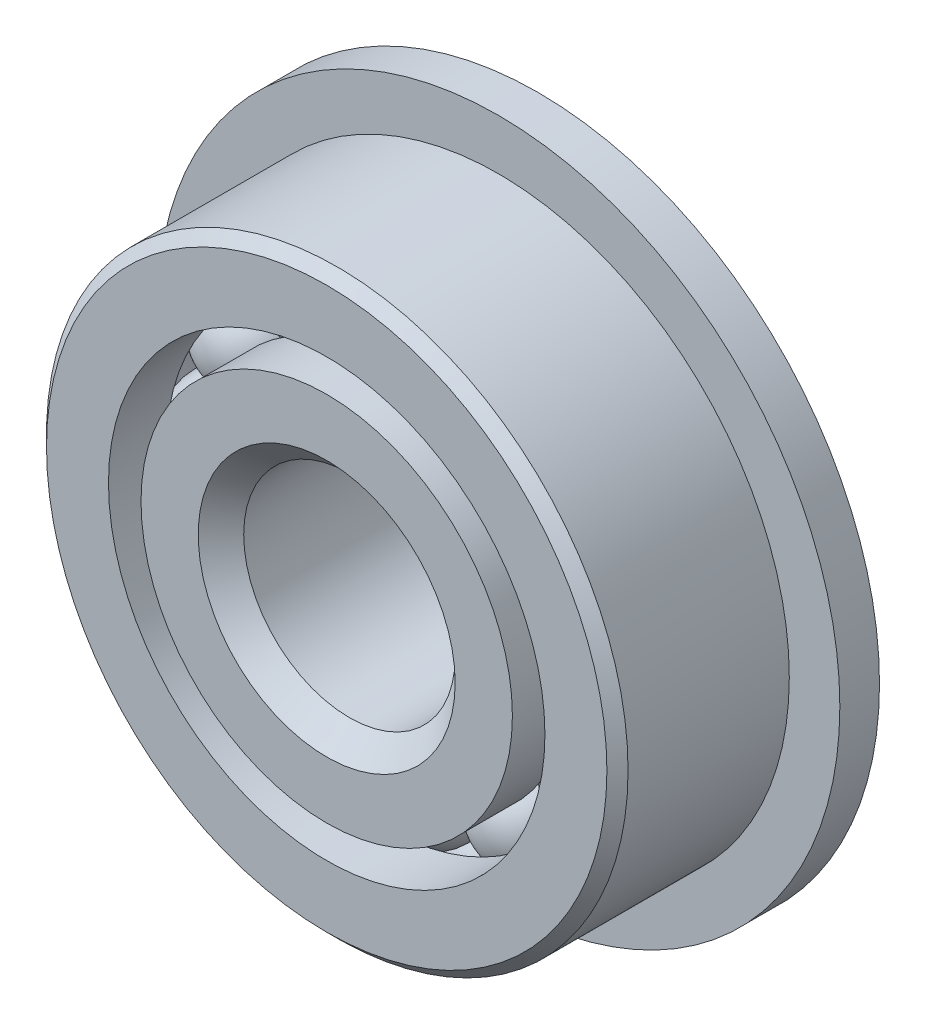
ISO-10303-21;
HEADER;
FILE_DESCRIPTION(('STEP AP214'),'2;1');
FILE_NAME('part.step','',(''),(''),'','','');
FILE_SCHEMA(('AUTOMOTIVE_DESIGN { 1 0 10303 214 1 1 1 1 }'));
ENDSEC;
DATA;
#1=APPLICATION_CONTEXT('core data for automotive mechanical design processes');
#2=APPLICATION_PROTOCOL_DEFINITION('international standard','automotive_design',2000,#1);
#3=PRODUCT_CONTEXT('',#1,'mechanical');
#4=PRODUCT('Part','Part','',(#3));
#5=PRODUCT_RELATED_PRODUCT_CATEGORY('part','',(#4));
#6=PRODUCT_DEFINITION_FORMATION('','',#4);
#7=PRODUCT_DEFINITION_CONTEXT('part definition',#1,'design');
#8=PRODUCT_DEFINITION('design','',#6,#7);
#9=PRODUCT_DEFINITION_SHAPE('','',#8);
#10=(LENGTH_UNIT() NAMED_UNIT(*) SI_UNIT(.MILLI.,.METRE.));
#11=(NAMED_UNIT(*) PLANE_ANGLE_UNIT() SI_UNIT($,.RADIAN.));
#12=(NAMED_UNIT(*) SI_UNIT($,.STERADIAN.) SOLID_ANGLE_UNIT());
#13=UNCERTAINTY_MEASURE_WITH_UNIT(LENGTH_MEASURE(1.E-05),#10,'distance_accuracy_value','');
#14=(GEOMETRIC_REPRESENTATION_CONTEXT(3) GLOBAL_UNCERTAINTY_ASSIGNED_CONTEXT((#13)) GLOBAL_UNIT_ASSIGNED_CONTEXT((#10,
#11,#12)) REPRESENTATION_CONTEXT('',''));
#15=CARTESIAN_POINT('',(0.,0.,0.));
#16=DIRECTION('',(0.,0.,1.));
#17=DIRECTION('',(1.,0.,0.));
#18=AXIS2_PLACEMENT_3D('',#15,#16,#17);
#19=CARTESIAN_POINT('',(-3.03212499999993,5.25179455489982,0.));
#20=DIRECTION('',(0.,0.,1.));
#21=DIRECTION('',(-0.499999999999989,0.866025403784445,0.));
#22=AXIS2_PLACEMENT_3D('',#19,#20,#21);
#23=SPHERICAL_SURFACE('',#22,1.524);
#24=CARTESIAN_POINT('',(-3.03212499999993,5.25179455489982,1.524));
#25=VERTEX_POINT('',#24);
#26=VERTEX_LOOP('',#25);
#27=FACE_BOUND('',#26,.T.);
#28=ADVANCED_FACE('F33',(#27),#23,.T.);
#29=CLOSED_SHELL('',(#28));
#30=MANIFOLD_SOLID_BREP('B2',#29);
#31=CARTESIAN_POINT('',(-5.25179455489975,3.03212500000006,0.));
#32=DIRECTION('',(0.,0.,1.));
#33=DIRECTION('',(-0.866025403784433,0.50000000000001,0.));
#34=AXIS2_PLACEMENT_3D('',#31,#32,#33);
#35=SPHERICAL_SURFACE('',#34,1.524);
#36=CARTESIAN_POINT('',(-5.25179455489975,3.03212500000006,1.524));
#37=VERTEX_POINT('',#36);
#38=VERTEX_LOOP('',#37);
#39=FACE_BOUND('',#38,.T.);
#40=ADVANCED_FACE('F51',(#39),#35,.T.);
#41=CLOSED_SHELL('',(#40));
#42=MANIFOLD_SOLID_BREP('B6',#41);
#43=CARTESIAN_POINT('',(-6.06425,0.,0.));
#44=DIRECTION('',(0.,0.,1.));
#45=DIRECTION('',(-1.,0.,0.));
#46=AXIS2_PLACEMENT_3D('',#43,#44,#45);
#47=SPHERICAL_SURFACE('',#46,1.524);
#48=CARTESIAN_POINT('',(-6.06425,0.,1.524));
#49=VERTEX_POINT('',#48);
#50=VERTEX_LOOP('',#49);
#51=FACE_BOUND('',#50,.T.);
#52=ADVANCED_FACE('F69',(#51),#47,.T.);
#53=CLOSED_SHELL('',(#52));
#54=MANIFOLD_SOLID_BREP('B29',#53);
#55=CARTESIAN_POINT('',(-5.25179455489981,-3.03212499999995,0.));
#56=DIRECTION('',(0.,0.,1.));
#57=DIRECTION('',(-0.866025403784443,-0.499999999999992,0.));
#58=AXIS2_PLACEMENT_3D('',#55,#56,#57);
#59=SPHERICAL_SURFACE('',#58,1.524);
#60=CARTESIAN_POINT('',(-5.25179455489981,-3.03212499999995,1.524));
#61=VERTEX_POINT('',#60);
#62=VERTEX_LOOP('',#61);
#63=FACE_BOUND('',#62,.T.);
#64=ADVANCED_FACE('F87',(#63),#59,.T.);
#65=CLOSED_SHELL('',(#64));
#66=MANIFOLD_SOLID_BREP('B47',#65);
#67=CARTESIAN_POINT('',(-3.03212500000004,-5.25179455489976,0.));
#68=DIRECTION('',(0.,0.,1.));
#69=DIRECTION('',(-0.500000000000007,-0.866025403784435,0.));
#70=AXIS2_PLACEMENT_3D('',#67,#68,#69);
#71=SPHERICAL_SURFACE('',#70,1.524);
#72=CARTESIAN_POINT('',(-3.03212500000004,-5.25179455489976,1.524));
#73=VERTEX_POINT('',#72);
#74=VERTEX_LOOP('',#73);
#75=FACE_BOUND('',#74,.T.);
#76=ADVANCED_FACE('F105',(#75),#71,.T.);
#77=CLOSED_SHELL('',(#76));
#78=MANIFOLD_SOLID_BREP('B65',#77);
#79=CARTESIAN_POINT('',(0.,-6.06425,0.));
#80=DIRECTION('',(0.,0.,1.));
#81=DIRECTION('',(0.,-1.,0.));
#82=AXIS2_PLACEMENT_3D('',#79,#80,#81);
#83=SPHERICAL_SURFACE('',#82,1.524);
#84=CARTESIAN_POINT('',(0.,-6.06425,1.524));
#85=VERTEX_POINT('',#84);
#86=VERTEX_LOOP('',#85);
#87=FACE_BOUND('',#86,.T.);
#88=ADVANCED_FACE('F123',(#87),#83,.T.);
#89=CLOSED_SHELL('',(#88));
#90=MANIFOLD_SOLID_BREP('B83',#89);
#91=CARTESIAN_POINT('',(3.03212499999997,-5.2517945548998,0.));
#92=DIRECTION('',(0.,0.,1.));
#93=DIRECTION('',(0.499999999999995,-0.866025403784442,0.));
#94=AXIS2_PLACEMENT_3D('',#91,#92,#93);
#95=SPHERICAL_SURFACE('',#94,1.524);
#96=CARTESIAN_POINT('',(3.03212499999997,-5.2517945548998,1.524));
#97=VERTEX_POINT('',#96);
#98=VERTEX_LOOP('',#97);
#99=FACE_BOUND('',#98,.T.);
#100=ADVANCED_FACE('F141',(#99),#95,.T.);
#101=CLOSED_SHELL('',(#100));
#102=MANIFOLD_SOLID_BREP('B101',#101);
#103=CARTESIAN_POINT('',(5.25179455489977,-3.03212500000002,0.));
#104=DIRECTION('',(0.,0.,1.));
#105=DIRECTION('',(0.866025403784436,-0.500000000000004,0.));
#106=AXIS2_PLACEMENT_3D('',#103,#104,#105);
#107=SPHERICAL_SURFACE('',#106,1.524);
#108=CARTESIAN_POINT('',(5.25179455489977,-3.03212500000002,1.524));
#109=VERTEX_POINT('',#108);
#110=VERTEX_LOOP('',#109);
#111=FACE_BOUND('',#110,.T.);
#112=ADVANCED_FACE('F159',(#111),#107,.T.);
#113=CLOSED_SHELL('',(#112));
#114=MANIFOLD_SOLID_BREP('B119',#113);
#115=CARTESIAN_POINT('',(6.06425,0.,0.));
#116=DIRECTION('',(0.,0.,1.));
#117=DIRECTION('',(1.,0.,0.));
#118=AXIS2_PLACEMENT_3D('',#115,#116,#117);
#119=SPHERICAL_SURFACE('',#118,1.524);
#120=CARTESIAN_POINT('',(6.06425,0.,1.524));
#121=VERTEX_POINT('',#120);
#122=VERTEX_LOOP('',#121);
#123=FACE_BOUND('',#122,.T.);
#124=ADVANCED_FACE('F177',(#123),#119,.T.);
#125=CLOSED_SHELL('',(#124));
#126=MANIFOLD_SOLID_BREP('B137',#125);
#127=CARTESIAN_POINT('',(5.25179455489979,3.03212499999999,0.));
#128=DIRECTION('',(0.,0.,1.));
#129=DIRECTION('',(0.86602540378444,0.499999999999998,0.));
#130=AXIS2_PLACEMENT_3D('',#127,#128,#129);
#131=SPHERICAL_SURFACE('',#130,1.524);
#132=CARTESIAN_POINT('',(5.25179455489979,3.03212499999999,1.524));
#133=VERTEX_POINT('',#132);
#134=VERTEX_LOOP('',#133);
#135=FACE_BOUND('',#134,.T.);
#136=ADVANCED_FACE('F195',(#135),#131,.T.);
#137=CLOSED_SHELL('',(#136));
#138=MANIFOLD_SOLID_BREP('B155',#137);
#139=CARTESIAN_POINT('',(3.03212500000001,5.25179455489978,0.));
#140=DIRECTION('',(0.,0.,1.));
#141=DIRECTION('',(0.500000000000001,0.866025403784438,0.));
#142=AXIS2_PLACEMENT_3D('',#139,#140,#141);
#143=SPHERICAL_SURFACE('',#142,1.524);
#144=CARTESIAN_POINT('',(3.03212500000001,5.25179455489978,1.524));
#145=VERTEX_POINT('',#144);
#146=VERTEX_LOOP('',#145);
#147=FACE_BOUND('',#146,.T.);
#148=ADVANCED_FACE('F213',(#147),#143,.T.);
#149=CLOSED_SHELL('',(#148));
#150=MANIFOLD_SOLID_BREP('B173',#149);
#151=CARTESIAN_POINT('',(0.,6.06425,0.));
#152=DIRECTION('',(0.,0.,1.));
#153=DIRECTION('',(0.,1.,0.));
#154=AXIS2_PLACEMENT_3D('',#151,#152,#153);
#155=SPHERICAL_SURFACE('',#154,1.524);
#156=CARTESIAN_POINT('',(0.,6.06425,1.524));
#157=VERTEX_POINT('',#156);
#158=VERTEX_LOOP('',#157);
#159=FACE_BOUND('',#158,.T.);
#160=ADVANCED_FACE('F233',(#159),#155,.T.);
#161=CLOSED_SHELL('',(#160));
#162=MANIFOLD_SOLID_BREP('B191',#161);
#163=CARTESIAN_POINT('',(0.,0.,3.175));
#164=DIRECTION('',(0.,0.,1.));
#165=DIRECTION('',(1.,0.,0.));
#166=AXIS2_PLACEMENT_3D('',#163,#164,#165);
#167=CYLINDRICAL_SURFACE('',#166,5.57578846153846);
#168=CARTESIAN_POINT('',(0.,0.,-1.44360012657376));
#169=DIRECTION('',(0.,0.,1.));
#170=DIRECTION('',(1.,0.,0.));
#171=AXIS2_PLACEMENT_3D('',#168,#169,#170);
#172=CIRCLE('',#171,5.57578846153846);
#173=CARTESIAN_POINT('',(5.57578846153846,0.,-1.44360012657376));
#174=VERTEX_POINT('',#173);
#175=EDGE_CURVE('E263',#174,#174,#172,.T.);
#176=ORIENTED_EDGE('',*,*,#175,.F.);
#177=EDGE_LOOP('',(#176));
#178=FACE_BOUND('',#177,.T.);
#179=CARTESIAN_POINT('',(0.,0.,-4.7625));
#180=DIRECTION('',(0.,0.,1.));
#181=DIRECTION('',(1.,0.,0.));
#182=AXIS2_PLACEMENT_3D('',#179,#180,#181);
#183=CIRCLE('',#182,5.57578846153846);
#184=CARTESIAN_POINT('',(5.57578846153846,0.,-4.7625));
#185=VERTEX_POINT('',#184);
#186=EDGE_CURVE('E267',#185,#185,#183,.T.);
#187=ORIENTED_EDGE('',*,*,#186,.T.);
#188=EDGE_LOOP('',(#187));
#189=FACE_BOUND('',#188,.T.);
#190=ADVANCED_FACE('F252',(#178,#189),#167,.T.);
#191=CARTESIAN_POINT('',(0.,3.4925,-4.7625));
#192=DIRECTION('',(0.,0.,1.));
#193=DIRECTION('',(1.,0.,0.));
#194=AXIS2_PLACEMENT_3D('',#191,#192,#193);
#195=PLANE('',#194);
#196=ORIENTED_EDGE('',*,*,#186,.F.);
#197=EDGE_LOOP('',(#196));
#198=FACE_BOUND('',#197,.T.);
#199=CARTESIAN_POINT('',(0.,0.,-4.7625));
#200=DIRECTION('',(0.,0.,1.));
#201=DIRECTION('',(1.,0.,0.));
#202=AXIS2_PLACEMENT_3D('',#199,#200,#201);
#203=CIRCLE('',#202,3.4925);
#204=CARTESIAN_POINT('',(3.4925,0.,-4.7625));
#205=VERTEX_POINT('',#204);
#206=EDGE_CURVE('E272',#205,#205,#203,.T.);
#207=ORIENTED_EDGE('',*,*,#206,.T.);
#208=EDGE_LOOP('',(#207));
#209=FACE_BOUND('',#208,.T.);
#210=ADVANCED_FACE('F299',(#198,#209),#195,.F.);
#211=CARTESIAN_POINT('',(0.,0.,-4.445));
#212=DIRECTION('',(0.,0.,-1.));
#213=DIRECTION('',(-1.,0.,0.));
#214=AXIS2_PLACEMENT_3D('',#211,#212,#213);
#215=CONICAL_SURFACE('',#214,3.175,0.785398163397443);
#216=ORIENTED_EDGE('',*,*,#206,.F.);
#217=EDGE_LOOP('',(#216));
#218=FACE_BOUND('',#217,.T.);
#219=CARTESIAN_POINT('',(0.,0.,-4.445));
#220=DIRECTION('',(0.,0.,1.));
#221=DIRECTION('',(1.,0.,0.));
#222=AXIS2_PLACEMENT_3D('',#219,#220,#221);
#223=CIRCLE('',#222,3.175);
#224=CARTESIAN_POINT('',(3.175,0.,-4.445));
#225=VERTEX_POINT('',#224);
#226=EDGE_CURVE('E275',#225,#225,#223,.T.);
#227=ORIENTED_EDGE('',*,*,#226,.T.);
#228=EDGE_LOOP('',(#227));
#229=FACE_BOUND('',#228,.T.);
#230=ADVANCED_FACE('F305',(#218,#229),#215,.F.);
#231=CARTESIAN_POINT('',(0.,0.,3.175));
#232=DIRECTION('',(0.,0.,1.));
#233=DIRECTION('',(1.,0.,0.));
#234=AXIS2_PLACEMENT_3D('',#231,#232,#233);
#235=CYLINDRICAL_SURFACE('',#234,3.175);
#236=ORIENTED_EDGE('',*,*,#226,.F.);
#237=EDGE_LOOP('',(#236));
#238=FACE_BOUND('',#237,.T.);
#239=CARTESIAN_POINT('',(0.,0.,2.492375));
#240=DIRECTION('',(0.,0.,1.));
#241=DIRECTION('',(1.,0.,0.));
#242=AXIS2_PLACEMENT_3D('',#239,#240,#241);
#243=CIRCLE('',#242,3.175);
#244=CARTESIAN_POINT('',(3.175,0.,2.492375));
#245=VERTEX_POINT('',#244);
#246=EDGE_CURVE('E278',#245,#245,#243,.T.);
#247=ORIENTED_EDGE('',*,*,#246,.T.);
#248=EDGE_LOOP('',(#247));
#249=FACE_BOUND('',#248,.T.);
#250=ADVANCED_FACE('F295',(#238,#249),#235,.F.);
#251=CARTESIAN_POINT('',(0.,0.,3.175));
#252=DIRECTION('',(0.,0.,1.));
#253=DIRECTION('',(1.,0.,0.));
#254=AXIS2_PLACEMENT_3D('',#251,#252,#253);
#255=CONICAL_SURFACE('',#254,3.857625,0.78539816339745);
#256=ORIENTED_EDGE('',*,*,#246,.F.);
#257=EDGE_LOOP('',(#256));
#258=FACE_BOUND('',#257,.T.);
#259=CARTESIAN_POINT('',(0.,0.,3.175));
#260=DIRECTION('',(0.,0.,1.));
#261=DIRECTION('',(1.,0.,0.));
#262=AXIS2_PLACEMENT_3D('',#259,#260,#261);
#263=CIRCLE('',#262,3.857625);
#264=CARTESIAN_POINT('',(3.857625,0.,3.175));
#265=VERTEX_POINT('',#264);
#266=EDGE_CURVE('E281',#265,#265,#263,.T.);
#267=ORIENTED_EDGE('',*,*,#266,.T.);
#268=EDGE_LOOP('',(#267));
#269=FACE_BOUND('',#268,.T.);
#270=ADVANCED_FACE('F285',(#258,#269),#255,.F.);
#271=CARTESIAN_POINT('',(0.,5.57578846153846,3.175));
#272=DIRECTION('',(0.,0.,-1.));
#273=DIRECTION('',(-1.,0.,0.));
#274=AXIS2_PLACEMENT_3D('',#271,#272,#273);
#275=PLANE('',#274);
#276=CARTESIAN_POINT('',(0.,0.,3.175));
#277=DIRECTION('',(0.,0.,1.));
#278=DIRECTION('',(1.,0.,0.));
#279=AXIS2_PLACEMENT_3D('',#276,#277,#278);
#280=CIRCLE('',#279,5.57578846153846);
#281=CARTESIAN_POINT('',(5.57578846153846,0.,3.175));
#282=VERTEX_POINT('',#281);
#283=EDGE_CURVE('E259',#282,#282,#280,.T.);
#284=ORIENTED_EDGE('',*,*,#283,.T.);
#285=EDGE_LOOP('',(#284));
#286=FACE_BOUND('',#285,.T.);
#287=ORIENTED_EDGE('',*,*,#266,.F.);
#288=EDGE_LOOP('',(#287));
#289=FACE_BOUND('',#288,.T.);
#290=ADVANCED_FACE('F254',(#286,#289),#275,.F.);
#291=CARTESIAN_POINT('',(0.,0.,0.));
#292=DIRECTION('',(0.,0.,1.));
#293=DIRECTION('',(1.,0.,0.));
#294=AXIS2_PLACEMENT_3D('',#291,#292,#293);
#295=TOROIDAL_SURFACE('',#294,6.06425,1.524);
#296=CARTESIAN_POINT('',(0.,0.,1.44360012657376));
#297=DIRECTION('',(0.,0.,1.));
#298=DIRECTION('',(1.,0.,0.));
#299=AXIS2_PLACEMENT_3D('',#296,#297,#298);
#300=CIRCLE('',#299,5.57578846153846);
#301=CARTESIAN_POINT('',(5.57578846153846,0.,1.44360012657376));
#302=VERTEX_POINT('',#301);
#303=EDGE_CURVE('E232',#302,#302,#300,.T.);
#304=ORIENTED_EDGE('',*,*,#303,.F.);
#305=EDGE_LOOP('',(#304));
#306=FACE_BOUND('',#305,.T.);
#307=ORIENTED_EDGE('',*,*,#175,.T.);
#308=EDGE_LOOP('',(#307));
#309=FACE_BOUND('',#308,.T.);
#310=ADVANCED_FACE('F288',(#306,#309),#295,.F.);
#311=CARTESIAN_POINT('',(0.,0.,3.175));
#312=DIRECTION('',(0.,0.,1.));
#313=DIRECTION('',(1.,0.,0.));
#314=AXIS2_PLACEMENT_3D('',#311,#312,#313);
#315=CYLINDRICAL_SURFACE('',#314,5.57578846153846);
#316=ORIENTED_EDGE('',*,*,#283,.F.);
#317=EDGE_LOOP('',(#316));
#318=FACE_BOUND('',#317,.T.);
#319=ORIENTED_EDGE('',*,*,#303,.T.);
#320=EDGE_LOOP('',(#319));
#321=FACE_BOUND('',#320,.T.);
#322=ADVANCED_FACE('F293',(#318,#321),#315,.T.);
#323=CLOSED_SHELL('',(#190,#210,#230,#250,#270,#290,#310,#322));
#324=MANIFOLD_SOLID_BREP('B209',#323);
#325=CARTESIAN_POINT('',(0.,0.,2.8575));
#326=DIRECTION('',(0.,0.,-1.));
#327=DIRECTION('',(-1.,0.,0.));
#328=AXIS2_PLACEMENT_3D('',#325,#326,#327);
#329=CONICAL_SURFACE('',#328,8.73125,0.785398163397446);
#330=CARTESIAN_POINT('',(0.,0.,3.175));
#331=DIRECTION('',(0.,0.,1.));
#332=DIRECTION('',(1.,0.,0.));
#333=AXIS2_PLACEMENT_3D('',#330,#331,#332);
#334=CIRCLE('',#333,8.41375);
#335=CARTESIAN_POINT('',(8.41375,0.,3.175));
#336=VERTEX_POINT('',#335);
#337=EDGE_CURVE('E401',#336,#336,#334,.T.);
#338=ORIENTED_EDGE('',*,*,#337,.F.);
#339=EDGE_LOOP('',(#338));
#340=FACE_BOUND('',#339,.T.);
#341=CARTESIAN_POINT('',(0.,0.,2.8575));
#342=DIRECTION('',(0.,0.,1.));
#343=DIRECTION('',(1.,0.,0.));
#344=AXIS2_PLACEMENT_3D('',#341,#342,#343);
#345=CIRCLE('',#344,8.73125);
#346=CARTESIAN_POINT('',(8.73125,0.,2.8575));
#347=VERTEX_POINT('',#346);
#348=EDGE_CURVE('E251',#347,#347,#345,.T.);
#349=ORIENTED_EDGE('',*,*,#348,.T.);
#350=EDGE_LOOP('',(#349));
#351=FACE_BOUND('',#350,.T.);
#352=ADVANCED_FACE('F379',(#340,#351),#329,.T.);
#353=CARTESIAN_POINT('',(0.,0.,3.175));
#354=DIRECTION('',(0.,0.,1.));
#355=DIRECTION('',(1.,0.,0.));
#356=AXIS2_PLACEMENT_3D('',#353,#354,#355);
#357=CYLINDRICAL_SURFACE('',#356,8.73125);
#358=CARTESIAN_POINT('',(0.,0.,-1.984375));
#359=DIRECTION('',(0.,0.,1.));
#360=DIRECTION('',(1.,0.,0.));
#361=AXIS2_PLACEMENT_3D('',#358,#359,#360);
#362=CIRCLE('',#361,8.73125);
#363=CARTESIAN_POINT('',(8.73125,0.,-1.984375));
#364=VERTEX_POINT('',#363);
#365=EDGE_CURVE('E382',#364,#364,#362,.T.);
#366=ORIENTED_EDGE('',*,*,#365,.T.);
#367=EDGE_LOOP('',(#366));
#368=FACE_BOUND('',#367,.T.);
#369=ORIENTED_EDGE('',*,*,#348,.F.);
#370=EDGE_LOOP('',(#369));
#371=FACE_BOUND('',#370,.T.);
#372=ADVANCED_FACE('F422',(#368,#371),#357,.T.);
#373=CARTESIAN_POINT('',(0.,8.41375,-3.175));
#374=DIRECTION('',(0.,0.,1.));
#375=DIRECTION('',(1.,0.,0.));
#376=AXIS2_PLACEMENT_3D('',#373,#374,#375);
#377=PLANE('',#376);
#378=CARTESIAN_POINT('',(0.,0.,-3.175));
#379=DIRECTION('',(0.,0.,1.));
#380=DIRECTION('',(1.,0.,0.));
#381=AXIS2_PLACEMENT_3D('',#378,#379,#380);
#382=CIRCLE('',#381,6.55271153846154);
#383=CARTESIAN_POINT('',(6.55271153846154,0.,-3.175));
#384=VERTEX_POINT('',#383);
#385=EDGE_CURVE('E386',#384,#384,#382,.T.);
#386=ORIENTED_EDGE('',*,*,#385,.T.);
#387=EDGE_LOOP('',(#386));
#388=FACE_BOUND('',#387,.T.);
#389=CARTESIAN_POINT('',(0.,0.,-3.175));
#390=DIRECTION('',(0.,0.,-1.));
#391=DIRECTION('',(-1.,0.,0.));
#392=AXIS2_PLACEMENT_3D('',#389,#390,#391);
#393=CIRCLE('',#392,10.2489);
#394=CARTESIAN_POINT('',(-10.2489,0.,-3.175));
#395=VERTEX_POINT('',#394);
#396=EDGE_CURVE('E404',#395,#395,#393,.T.);
#397=ORIENTED_EDGE('',*,*,#396,.T.);
#398=EDGE_LOOP('',(#397));
#399=FACE_BOUND('',#398,.T.);
#400=ADVANCED_FACE('F425',(#388,#399),#377,.F.);
#401=CARTESIAN_POINT('',(0.,0.,3.175));
#402=DIRECTION('',(0.,0.,1.));
#403=DIRECTION('',(1.,0.,0.));
#404=AXIS2_PLACEMENT_3D('',#401,#402,#403);
#405=CYLINDRICAL_SURFACE('',#404,6.55271153846154);
#406=ORIENTED_EDGE('',*,*,#385,.F.);
#407=EDGE_LOOP('',(#406));
#408=FACE_BOUND('',#407,.T.);
#409=CARTESIAN_POINT('',(0.,0.,-1.44360012657376));
#410=DIRECTION('',(0.,0.,1.));
#411=DIRECTION('',(1.,0.,0.));
#412=AXIS2_PLACEMENT_3D('',#409,#410,#411);
#413=CIRCLE('',#412,6.55271153846154);
#414=CARTESIAN_POINT('',(6.55271153846154,0.,-1.44360012657376));
#415=VERTEX_POINT('',#414);
#416=EDGE_CURVE('E390',#415,#415,#413,.T.);
#417=ORIENTED_EDGE('',*,*,#416,.T.);
#418=EDGE_LOOP('',(#417));
#419=FACE_BOUND('',#418,.T.);
#420=ADVANCED_FACE('F430',(#408,#419),#405,.F.);
#421=CARTESIAN_POINT('',(0.,0.,0.));
#422=DIRECTION('',(0.,0.,1.));
#423=DIRECTION('',(1.,0.,0.));
#424=AXIS2_PLACEMENT_3D('',#421,#422,#423);
#425=TOROIDAL_SURFACE('',#424,6.06425,1.524);
#426=ORIENTED_EDGE('',*,*,#416,.F.);
#427=EDGE_LOOP('',(#426));
#428=FACE_BOUND('',#427,.T.);
#429=CARTESIAN_POINT('',(0.,0.,1.44360012657376));
#430=DIRECTION('',(0.,0.,1.));
#431=DIRECTION('',(1.,0.,0.));
#432=AXIS2_PLACEMENT_3D('',#429,#430,#431);
#433=CIRCLE('',#432,6.55271153846154);
#434=CARTESIAN_POINT('',(6.55271153846154,0.,1.44360012657376));
#435=VERTEX_POINT('',#434);
#436=EDGE_CURVE('E395',#435,#435,#433,.T.);
#437=ORIENTED_EDGE('',*,*,#436,.T.);
#438=EDGE_LOOP('',(#437));
#439=FACE_BOUND('',#438,.T.);
#440=ADVANCED_FACE('F437',(#428,#439),#425,.F.);
#441=CARTESIAN_POINT('',(0.,0.,3.175));
#442=DIRECTION('',(0.,0.,1.));
#443=DIRECTION('',(1.,0.,0.));
#444=AXIS2_PLACEMENT_3D('',#441,#442,#443);
#445=CYLINDRICAL_SURFACE('',#444,6.55271153846154);
#446=ORIENTED_EDGE('',*,*,#436,.F.);
#447=EDGE_LOOP('',(#446));
#448=FACE_BOUND('',#447,.T.);
#449=CARTESIAN_POINT('',(0.,0.,3.175));
#450=DIRECTION('',(0.,0.,1.));
#451=DIRECTION('',(1.,0.,0.));
#452=AXIS2_PLACEMENT_3D('',#449,#450,#451);
#453=CIRCLE('',#452,6.55271153846154);
#454=CARTESIAN_POINT('',(6.55271153846154,0.,3.175));
#455=VERTEX_POINT('',#454);
#456=EDGE_CURVE('E398',#455,#455,#453,.T.);
#457=ORIENTED_EDGE('',*,*,#456,.T.);
#458=EDGE_LOOP('',(#457));
#459=FACE_BOUND('',#458,.T.);
#460=ADVANCED_FACE('F441',(#448,#459),#445,.F.);
#461=CARTESIAN_POINT('',(0.,8.41375,3.175));
#462=DIRECTION('',(0.,0.,-1.));
#463=DIRECTION('',(-1.,0.,0.));
#464=AXIS2_PLACEMENT_3D('',#461,#462,#463);
#465=PLANE('',#464);
#466=ORIENTED_EDGE('',*,*,#456,.F.);
#467=EDGE_LOOP('',(#466));
#468=FACE_BOUND('',#467,.T.);
#469=ORIENTED_EDGE('',*,*,#337,.T.);
#470=EDGE_LOOP('',(#469));
#471=FACE_BOUND('',#470,.T.);
#472=ADVANCED_FACE('F417',(#468,#471),#465,.F.);
#473=CARTESIAN_POINT('',(0.,7.48323076923077,-1.984375));
#474=DIRECTION('',(0.,0.,1.));
#475=DIRECTION('',(1.,0.,0.));
#476=AXIS2_PLACEMENT_3D('',#473,#474,#475);
#477=PLANE('',#476);
#478=CARTESIAN_POINT('',(0.,0.,-1.984375));
#479=DIRECTION('',(0.,0.,-1.));
#480=DIRECTION('',(-1.,0.,0.));
#481=AXIS2_PLACEMENT_3D('',#478,#479,#480);
#482=CIRCLE('',#481,10.2489);
#483=CARTESIAN_POINT('',(-10.2489,0.,-1.984375));
#484=VERTEX_POINT('',#483);
#485=EDGE_CURVE('E407',#484,#484,#482,.T.);
#486=ORIENTED_EDGE('',*,*,#485,.F.);
#487=EDGE_LOOP('',(#486));
#488=FACE_BOUND('',#487,.T.);
#489=ORIENTED_EDGE('',*,*,#365,.F.);
#490=EDGE_LOOP('',(#489));
#491=FACE_BOUND('',#490,.T.);
#492=ADVANCED_FACE('F414',(#488,#491),#477,.T.);
#493=CARTESIAN_POINT('',(0.,0.,-4.7625));
#494=DIRECTION('',(0.,0.,-1.));
#495=DIRECTION('',(-1.,0.,0.));
#496=AXIS2_PLACEMENT_3D('',#493,#494,#495);
#497=CYLINDRICAL_SURFACE('',#496,10.2489);
#498=ORIENTED_EDGE('',*,*,#485,.T.);
#499=EDGE_LOOP('',(#498));
#500=FACE_BOUND('',#499,.T.);
#501=ORIENTED_EDGE('',*,*,#396,.F.);
#502=EDGE_LOOP('',(#501));
#503=FACE_BOUND('',#502,.T.);
#504=ADVANCED_FACE('F411',(#500,#503),#497,.T.);
#505=CLOSED_SHELL('',(#352,#372,#400,#420,#440,#460,#472,#492,#504));
#506=MANIFOLD_SOLID_BREP('B227',#505);
#507=ADVANCED_BREP_SHAPE_REPRESENTATION('',(#18,#30,#42,#54,#66,#78,#90,#102,#114,#126,#138,
#150,#162,#324,#506),#14);
#508=SHAPE_DEFINITION_REPRESENTATION(#9,#507);
ENDSEC;
END-ISO-10303-21;
